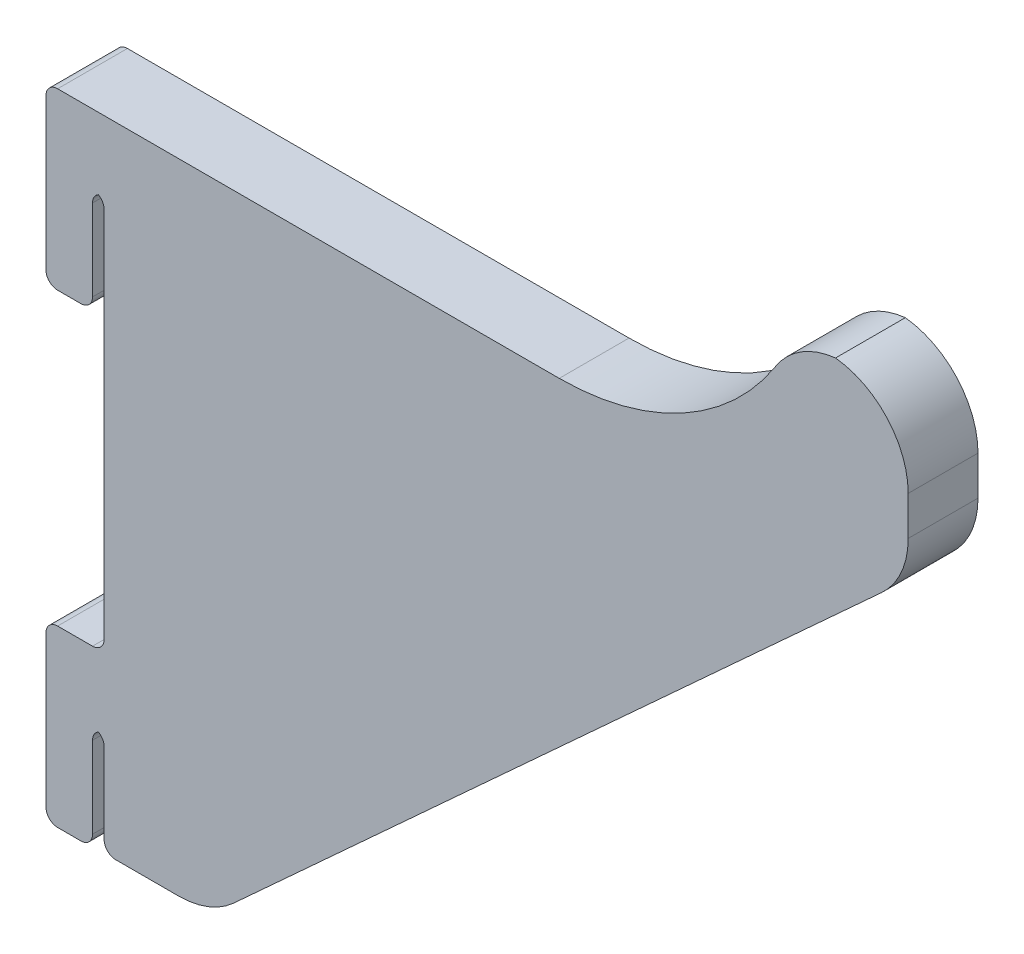
ISO-10303-21;
HEADER;
FILE_DESCRIPTION(('STEP AP214'),'2;1');
FILE_NAME('part.step','',(''),(''),'','','');
FILE_SCHEMA(('AUTOMOTIVE_DESIGN { 1 0 10303 214 1 1 1 1 }'));
ENDSEC;
DATA;
#1=APPLICATION_CONTEXT('core data for automotive mechanical design processes');
#2=APPLICATION_PROTOCOL_DEFINITION('international standard','automotive_design',2000,#1);
#3=PRODUCT_CONTEXT('',#1,'mechanical');
#4=PRODUCT('Part','Part','',(#3));
#5=PRODUCT_RELATED_PRODUCT_CATEGORY('part','',(#4));
#6=PRODUCT_DEFINITION_FORMATION('','',#4);
#7=PRODUCT_DEFINITION_CONTEXT('part definition',#1,'design');
#8=PRODUCT_DEFINITION('design','',#6,#7);
#9=PRODUCT_DEFINITION_SHAPE('','',#8);
#10=(LENGTH_UNIT() NAMED_UNIT(*) SI_UNIT(.MILLI.,.METRE.));
#11=(NAMED_UNIT(*) PLANE_ANGLE_UNIT() SI_UNIT($,.RADIAN.));
#12=(NAMED_UNIT(*) SI_UNIT($,.STERADIAN.) SOLID_ANGLE_UNIT());
#13=UNCERTAINTY_MEASURE_WITH_UNIT(LENGTH_MEASURE(1.E-05),#10,'distance_accuracy_value','');
#14=(GEOMETRIC_REPRESENTATION_CONTEXT(3) GLOBAL_UNCERTAINTY_ASSIGNED_CONTEXT((#13)) GLOBAL_UNIT_ASSIGNED_CONTEXT((#10,
#11,#12)) REPRESENTATION_CONTEXT('',''));
#15=CARTESIAN_POINT('',(0.,0.,0.));
#16=DIRECTION('',(0.,0.,1.));
#17=DIRECTION('',(1.,0.,0.));
#18=AXIS2_PLACEMENT_3D('',#15,#16,#17);
#19=CARTESIAN_POINT('',(0.,0.,3.));
#20=DIRECTION('',(0.,1.,0.));
#21=DIRECTION('',(-1.,0.,0.));
#22=AXIS2_PLACEMENT_3D('',#19,#20,#21);
#23=PLANE('',#22);
#24=DIRECTION('',(1.,0.,0.));
#25=VECTOR('',#24,1.);
#26=CARTESIAN_POINT('',(0.,0.,-3.));
#27=LINE('',#26,#25);
#28=CARTESIAN_POINT('',(-3.,0.,-3.));
#29=VERTEX_POINT('',#28);
#30=CARTESIAN_POINT('',(-1.,0.,-3.));
#31=VERTEX_POINT('',#30);
#32=EDGE_CURVE('E271',#29,#31,#27,.T.);
#33=ORIENTED_EDGE('',*,*,#32,.T.);
#34=DIRECTION('',(0.,0.,-1.));
#35=VECTOR('',#34,1.);
#36=CARTESIAN_POINT('',(-1.,0.,3.));
#37=LINE('',#36,#35);
#38=CARTESIAN_POINT('',(-1.,0.,3.));
#39=VERTEX_POINT('',#38);
#40=EDGE_CURVE('E355',#31,#39,#37,.F.);
#41=ORIENTED_EDGE('',*,*,#40,.T.);
#42=DIRECTION('',(1.,0.,0.));
#43=VECTOR('',#42,1.);
#44=CARTESIAN_POINT('',(0.,0.,3.));
#45=LINE('',#44,#43);
#46=CARTESIAN_POINT('',(-3.,0.,3.));
#47=VERTEX_POINT('',#46);
#48=EDGE_CURVE('E310',#47,#39,#45,.T.);
#49=ORIENTED_EDGE('',*,*,#48,.F.);
#50=DIRECTION('',(0.,0.,-1.));
#51=VECTOR('',#50,1.);
#52=CARTESIAN_POINT('',(-3.,0.,3.));
#53=LINE('',#52,#51);
#54=EDGE_CURVE('E352',#47,#29,#53,.T.);
#55=ORIENTED_EDGE('',*,*,#54,.T.);
#56=EDGE_LOOP('',(#33,#41,#49,#55));
#57=FACE_BOUND('',#56,.T.);
#58=ADVANCED_FACE('F33',(#57),#23,.F.);
#59=CARTESIAN_POINT('',(0.,0.,3.));
#60=DIRECTION('',(-1.,0.,0.));
#61=DIRECTION('',(0.,-1.,0.));
#62=AXIS2_PLACEMENT_3D('',#59,#60,#61);
#63=PLANE('',#62);
#64=DIRECTION('',(0.,1.,0.));
#65=VECTOR('',#64,1.);
#66=CARTESIAN_POINT('',(0.,0.,-3.));
#67=LINE('',#66,#65);
#68=CARTESIAN_POINT('',(0.,1.,-3.));
#69=VERTEX_POINT('',#68);
#70=CARTESIAN_POINT('',(0.,8.,-3.));
#71=VERTEX_POINT('',#70);
#72=EDGE_CURVE('E274',#69,#71,#67,.T.);
#73=ORIENTED_EDGE('',*,*,#72,.T.);
#74=DIRECTION('',(0.,0.,-1.));
#75=VECTOR('',#74,1.);
#76=CARTESIAN_POINT('',(0.,8.,3.));
#77=LINE('',#76,#75);
#78=CARTESIAN_POINT('',(0.,8.,3.));
#79=VERTEX_POINT('',#78);
#80=EDGE_CURVE('E350',#71,#79,#77,.F.);
#81=ORIENTED_EDGE('',*,*,#80,.T.);
#82=DIRECTION('',(0.,1.,0.));
#83=VECTOR('',#82,1.);
#84=CARTESIAN_POINT('',(0.,0.,3.));
#85=LINE('',#84,#83);
#86=CARTESIAN_POINT('',(0.,1.,3.));
#87=VERTEX_POINT('',#86);
#88=EDGE_CURVE('E464',#87,#79,#85,.T.);
#89=ORIENTED_EDGE('',*,*,#88,.F.);
#90=DIRECTION('',(0.,0.,-1.));
#91=VECTOR('',#90,1.);
#92=CARTESIAN_POINT('',(0.,1.,3.));
#93=LINE('',#92,#91);
#94=EDGE_CURVE('E347',#87,#69,#93,.T.);
#95=ORIENTED_EDGE('',*,*,#94,.T.);
#96=EDGE_LOOP('',(#73,#81,#89,#95));
#97=FACE_BOUND('',#96,.T.);
#98=ADVANCED_FACE('F480',(#97),#63,.F.);
#99=CARTESIAN_POINT('',(1.,9.,3.));
#100=DIRECTION('',(1.,0.,0.));
#101=DIRECTION('',(0.,1.,0.));
#102=AXIS2_PLACEMENT_3D('',#99,#100,#101);
#103=PLANE('',#102);
#104=DIRECTION('',(0.,-1.,0.));
#105=VECTOR('',#104,1.);
#106=CARTESIAN_POINT('',(1.,9.,-3.));
#107=LINE('',#106,#105);
#108=CARTESIAN_POINT('',(1.,8.,-3.));
#109=VERTEX_POINT('',#108);
#110=CARTESIAN_POINT('',(1.,1.09638947990709,-3.));
#111=VERTEX_POINT('',#110);
#112=EDGE_CURVE('E278',#109,#111,#107,.T.);
#113=ORIENTED_EDGE('',*,*,#112,.T.);
#114=DIRECTION('',(0.,0.,-1.));
#115=VECTOR('',#114,1.);
#116=CARTESIAN_POINT('',(1.,1.09638947990709,3.));
#117=LINE('',#116,#115);
#118=CARTESIAN_POINT('',(1.,1.09638947990709,3.));
#119=VERTEX_POINT('',#118);
#120=EDGE_CURVE('E331',#111,#119,#117,.F.);
#121=ORIENTED_EDGE('',*,*,#120,.T.);
#122=DIRECTION('',(0.,-1.,0.));
#123=VECTOR('',#122,1.);
#124=CARTESIAN_POINT('',(1.,9.,3.));
#125=LINE('',#124,#123);
#126=CARTESIAN_POINT('',(1.,8.,3.));
#127=VERTEX_POINT('',#126);
#128=EDGE_CURVE('E461',#127,#119,#125,.T.);
#129=ORIENTED_EDGE('',*,*,#128,.F.);
#130=DIRECTION('',(0.,0.,-1.));
#131=VECTOR('',#130,1.);
#132=CARTESIAN_POINT('',(1.,8.,-3.));
#133=LINE('',#132,#131);
#134=EDGE_CURVE('E328',#127,#109,#133,.T.);
#135=ORIENTED_EDGE('',*,*,#134,.T.);
#136=EDGE_LOOP('',(#113,#121,#129,#135));
#137=FACE_BOUND('',#136,.T.);
#138=ADVANCED_FACE('F496',(#137),#103,.F.);
#139=CARTESIAN_POINT('',(1.00000000000001,0.0963894799070881,3.));
#140=DIRECTION('',(0.,1.,0.));
#141=DIRECTION('',(0.,0.,1.));
#142=AXIS2_PLACEMENT_3D('',#139,#140,#141);
#143=PLANE('',#142);
#144=DIRECTION('',(1.,0.,0.));
#145=VECTOR('',#144,1.);
#146=CARTESIAN_POINT('',(1.00000000000001,0.0963894799070881,-3.));
#147=LINE('',#146,#145);
#148=CARTESIAN_POINT('',(2.,0.0963894799070881,-3.));
#149=VERTEX_POINT('',#148);
#150=CARTESIAN_POINT('',(7.40250766942312,0.0963894799070881,-3.));
#151=VERTEX_POINT('',#150);
#152=EDGE_CURVE('E281',#149,#151,#147,.T.);
#153=ORIENTED_EDGE('',*,*,#152,.T.);
#154=DIRECTION('',(0.,0.,-1.));
#155=VECTOR('',#154,1.);
#156=CARTESIAN_POINT('',(7.40250766942312,0.0963894799070881,3.));
#157=LINE('',#156,#155);
#158=CARTESIAN_POINT('',(7.40250766942312,0.0963894799070881,3.));
#159=VERTEX_POINT('',#158);
#160=EDGE_CURVE('E426',#151,#159,#157,.F.);
#161=ORIENTED_EDGE('',*,*,#160,.T.);
#162=DIRECTION('',(1.,0.,0.));
#163=VECTOR('',#162,1.);
#164=CARTESIAN_POINT('',(1.00000000000001,0.0963894799070881,3.));
#165=LINE('',#164,#163);
#166=CARTESIAN_POINT('',(2.,0.0963894799070881,3.));
#167=VERTEX_POINT('',#166);
#168=EDGE_CURVE('E457',#167,#159,#165,.T.);
#169=ORIENTED_EDGE('',*,*,#168,.F.);
#170=DIRECTION('',(0.,0.,-1.));
#171=VECTOR('',#170,1.);
#172=CARTESIAN_POINT('',(2.,0.0963894799070881,3.));
#173=LINE('',#172,#171);
#174=EDGE_CURVE('E245',#167,#149,#173,.T.);
#175=ORIENTED_EDGE('',*,*,#174,.T.);
#176=EDGE_LOOP('',(#153,#161,#169,#175));
#177=FACE_BOUND('',#176,.T.);
#178=ADVANCED_FACE('F504',(#177),#143,.F.);
#179=CARTESIAN_POINT('',(70.1218736182205,55.,3.));
#180=DIRECTION('',(-0.675080348465986,0.737744212525617,0.));
#181=DIRECTION('',(-0.737744212525617,-0.675080348465986,0.));
#182=AXIS2_PLACEMENT_3D('',#179,#180,#181);
#183=PLANE('',#182);
#184=DIRECTION('',(0.737744212525617,0.675080348465986,0.));
#185=VECTOR('',#184,1.);
#186=CARTESIAN_POINT('',(70.1218736182205,55.,3.));
#187=LINE('',#186,#185);
#188=CARTESIAN_POINT('',(12.128070108685,1.93217999222776,3.));
#189=VERTEX_POINT('',#188);
#190=CARTESIAN_POINT('',(67.8474360574824,52.9187527668827,3.));
#191=VERTEX_POINT('',#190);
#192=EDGE_CURVE('E456',#189,#191,#187,.T.);
#193=ORIENTED_EDGE('',*,*,#192,.F.);
#194=DIRECTION('',(0.,0.,-1.));
#195=VECTOR('',#194,1.);
#196=CARTESIAN_POINT('',(12.128070108685,1.93217999222776,3.));
#197=LINE('',#196,#195);
#198=CARTESIAN_POINT('',(12.128070108685,1.93217999222776,-3.));
#199=VERTEX_POINT('',#198);
#200=EDGE_CURVE('E415',#189,#199,#197,.T.);
#201=ORIENTED_EDGE('',*,*,#200,.T.);
#202=DIRECTION('',(0.737744212525617,0.675080348465986,0.));
#203=VECTOR('',#202,1.);
#204=CARTESIAN_POINT('',(70.1218736182205,55.,-3.));
#205=LINE('',#204,#203);
#206=CARTESIAN_POINT('',(67.8474360574824,52.9187527668827,-3.));
#207=VERTEX_POINT('',#206);
#208=EDGE_CURVE('E284',#199,#207,#205,.T.);
#209=ORIENTED_EDGE('',*,*,#208,.T.);
#210=DIRECTION('',(0.,0.,-1.));
#211=VECTOR('',#210,1.);
#212=CARTESIAN_POINT('',(67.8474360574824,52.9187527668827,3.));
#213=LINE('',#212,#211);
#214=EDGE_CURVE('E408',#207,#191,#213,.F.);
#215=ORIENTED_EDGE('',*,*,#214,.T.);
#216=EDGE_LOOP('',(#193,#201,#209,#215));
#217=FACE_BOUND('',#216,.T.);
#218=ADVANCED_FACE('F512',(#217),#183,.F.);
#219=CARTESIAN_POINT('',(70.1218736182205,68.4361947626841,3.));
#220=DIRECTION('',(-1.,0.,0.));
#221=DIRECTION('',(0.,0.,1.));
#222=AXIS2_PLACEMENT_3D('',#219,#220,#221);
#223=PLANE('',#222);
#224=DIRECTION('',(0.,1.,0.));
#225=VECTOR('',#224,1.);
#226=CARTESIAN_POINT('',(70.1218736182205,68.4361947626841,3.));
#227=LINE('',#226,#225);
#228=CARTESIAN_POINT('',(70.1218736182205,58.0829622545621,3.));
#229=VERTEX_POINT('',#228);
#230=CARTESIAN_POINT('',(70.1218736182205,61.4361947626841,3.));
#231=VERTEX_POINT('',#230);
#232=EDGE_CURVE('E235',#229,#231,#227,.T.);
#233=ORIENTED_EDGE('',*,*,#232,.F.);
#234=DIRECTION('',(0.,0.,-1.));
#235=VECTOR('',#234,1.);
#236=CARTESIAN_POINT('',(70.1218736182205,58.0829622545621,3.));
#237=LINE('',#236,#235);
#238=CARTESIAN_POINT('',(70.1218736182205,58.0829622545621,-3.));
#239=VERTEX_POINT('',#238);
#240=EDGE_CURVE('E42',#229,#239,#237,.T.);
#241=ORIENTED_EDGE('',*,*,#240,.T.);
#242=DIRECTION('',(0.,1.,0.));
#243=VECTOR('',#242,1.);
#244=CARTESIAN_POINT('',(70.1218736182205,68.4361947626841,-3.));
#245=LINE('',#244,#243);
#246=CARTESIAN_POINT('',(70.1218736182205,61.4361947626841,-3.));
#247=VERTEX_POINT('',#246);
#248=EDGE_CURVE('E287',#239,#247,#245,.T.);
#249=ORIENTED_EDGE('',*,*,#248,.T.);
#250=DIRECTION('',(0.,0.,-1.));
#251=VECTOR('',#250,1.);
#252=CARTESIAN_POINT('',(70.1218736182205,61.4361947626841,3.));
#253=LINE('',#252,#251);
#254=EDGE_CURVE('E434',#247,#231,#253,.F.);
#255=ORIENTED_EDGE('',*,*,#254,.T.);
#256=EDGE_LOOP('',(#233,#241,#249,#255));
#257=FACE_BOUND('',#256,.T.);
#258=ADVANCED_FACE('F442',(#257),#223,.F.);
#259=CARTESIAN_POINT('',(40.1218736182205,77.0691221980383,3.));
#260=DIRECTION('',(0.,0.,-1.));
#261=DIRECTION('',(-1.,0.,0.));
#262=AXIS2_PLACEMENT_3D('',#259,#260,#261);
#263=CYLINDRICAL_SURFACE('',#262,22.0691221980383);
#264=CARTESIAN_POINT('',(40.1218736182205,77.0691221980383,3.));
#265=DIRECTION('',(0.,0.,-1.));
#266=DIRECTION('',(1.,0.,0.));
#267=AXIS2_PLACEMENT_3D('',#264,#265,#266);
#268=CIRCLE('',#267,22.0691221980383);
#269=CARTESIAN_POINT('',(58.727958816641,65.2006872472513,3.));
#270=VERTEX_POINT('',#269);
#271=CARTESIAN_POINT('',(40.1218736182205,55.,3.));
#272=VERTEX_POINT('',#271);
#273=EDGE_CURVE('E226',#270,#272,#268,.T.);
#274=ORIENTED_EDGE('',*,*,#273,.F.);
#275=DIRECTION('',(0.,0.,-1.));
#276=VECTOR('',#275,1.);
#277=CARTESIAN_POINT('',(58.727958816641,65.2006872472513,3.));
#278=LINE('',#277,#276);
#279=CARTESIAN_POINT('',(58.727958816641,65.2006872472513,-3.));
#280=VERTEX_POINT('',#279);
#281=EDGE_CURVE('E11',#270,#280,#278,.T.);
#282=ORIENTED_EDGE('',*,*,#281,.T.);
#283=CARTESIAN_POINT('',(40.1218736182205,77.0691221980383,-3.));
#284=DIRECTION('',(0.,0.,-1.));
#285=DIRECTION('',(1.,0.,0.));
#286=AXIS2_PLACEMENT_3D('',#283,#284,#285);
#287=CIRCLE('',#286,22.0691221980383);
#288=CARTESIAN_POINT('',(40.1218736182205,55.,-3.));
#289=VERTEX_POINT('',#288);
#290=EDGE_CURVE('E241',#280,#289,#287,.T.);
#291=ORIENTED_EDGE('',*,*,#290,.T.);
#292=DIRECTION('',(0.,0.,-1.));
#293=VECTOR('',#292,1.);
#294=CARTESIAN_POINT('',(40.1218736182205,55.,3.));
#295=LINE('',#294,#293);
#296=EDGE_CURVE('E238',#272,#289,#295,.T.);
#297=ORIENTED_EDGE('',*,*,#296,.F.);
#298=EDGE_LOOP('',(#274,#282,#291,#297));
#299=FACE_BOUND('',#298,.T.);
#300=ADVANCED_FACE('F239',(#299),#263,.F.);
#301=CARTESIAN_POINT('',(10.1218736182205,55.,3.));
#302=DIRECTION('',(0.,-1.,0.));
#303=DIRECTION('',(0.,0.,-1.));
#304=AXIS2_PLACEMENT_3D('',#301,#302,#303);
#305=PLANE('',#304);
#306=DIRECTION('',(-1.,0.,0.));
#307=VECTOR('',#306,1.);
#308=CARTESIAN_POINT('',(10.1218736182205,55.,-3.));
#309=LINE('',#308,#307);
#310=CARTESIAN_POINT('',(-3.00000000000003,55.,-3.));
#311=VERTEX_POINT('',#310);
#312=EDGE_CURVE('E291',#289,#311,#309,.T.);
#313=ORIENTED_EDGE('',*,*,#312,.T.);
#314=DIRECTION('',(0.,0.,-1.));
#315=VECTOR('',#314,1.);
#316=CARTESIAN_POINT('',(-3.00000000000003,55.,3.));
#317=LINE('',#316,#315);
#318=CARTESIAN_POINT('',(-3.00000000000003,55.,3.));
#319=VERTEX_POINT('',#318);
#320=EDGE_CURVE('E250',#311,#319,#317,.F.);
#321=ORIENTED_EDGE('',*,*,#320,.T.);
#322=DIRECTION('',(-1.,0.,0.));
#323=VECTOR('',#322,1.);
#324=CARTESIAN_POINT('',(40.1218736182205,55.,3.));
#325=LINE('',#324,#323);
#326=EDGE_CURVE('E231',#272,#319,#325,.T.);
#327=ORIENTED_EDGE('',*,*,#326,.F.);
#328=ORIENTED_EDGE('',*,*,#296,.T.);
#329=EDGE_LOOP('',(#313,#321,#327,#328));
#330=FACE_BOUND('',#329,.T.);
#331=ADVANCED_FACE('F248',(#330),#305,.F.);
#332=CARTESIAN_POINT('',(-4.00000000000003,40.,3.));
#333=DIRECTION('',(1.,0.,0.));
#334=DIRECTION('',(0.,0.,-1.));
#335=AXIS2_PLACEMENT_3D('',#332,#333,#334);
#336=PLANE('',#335);
#337=DIRECTION('',(0.,-1.,0.));
#338=VECTOR('',#337,1.);
#339=CARTESIAN_POINT('',(-4.00000000000003,40.,-3.));
#340=LINE('',#339,#338);
#341=CARTESIAN_POINT('',(-4.00000000000003,54.,-3.));
#342=VERTEX_POINT('',#341);
#343=CARTESIAN_POINT('',(-4.00000000000003,41.,-3.));
#344=VERTEX_POINT('',#343);
#345=EDGE_CURVE('E293',#342,#344,#340,.T.);
#346=ORIENTED_EDGE('',*,*,#345,.T.);
#347=DIRECTION('',(0.,0.,-1.));
#348=VECTOR('',#347,1.);
#349=CARTESIAN_POINT('',(-4.00000000000003,41.,3.));
#350=LINE('',#349,#348);
#351=CARTESIAN_POINT('',(-4.00000000000003,41.,3.));
#352=VERTEX_POINT('',#351);
#353=EDGE_CURVE('E385',#344,#352,#350,.F.);
#354=ORIENTED_EDGE('',*,*,#353,.T.);
#355=DIRECTION('',(0.,-1.,0.));
#356=VECTOR('',#355,1.);
#357=CARTESIAN_POINT('',(-4.00000000000003,40.,3.));
#358=LINE('',#357,#356);
#359=CARTESIAN_POINT('',(-4.00000000000003,54.,3.));
#360=VERTEX_POINT('',#359);
#361=EDGE_CURVE('E251',#360,#352,#358,.T.);
#362=ORIENTED_EDGE('',*,*,#361,.F.);
#363=DIRECTION('',(0.,0.,-1.));
#364=VECTOR('',#363,1.);
#365=CARTESIAN_POINT('',(-4.00000000000003,54.,3.));
#366=LINE('',#365,#364);
#367=EDGE_CURVE('E382',#360,#342,#366,.T.);
#368=ORIENTED_EDGE('',*,*,#367,.T.);
#369=EDGE_LOOP('',(#346,#354,#362,#368));
#370=FACE_BOUND('',#369,.T.);
#371=ADVANCED_FACE('F613',(#370),#336,.F.);
#372=CARTESIAN_POINT('',(0.,40.,3.));
#373=DIRECTION('',(0.,1.,0.));
#374=DIRECTION('',(-1.,0.,0.));
#375=AXIS2_PLACEMENT_3D('',#372,#373,#374);
#376=PLANE('',#375);
#377=DIRECTION('',(1.,0.,0.));
#378=VECTOR('',#377,1.);
#379=CARTESIAN_POINT('',(0.,40.,-3.));
#380=LINE('',#379,#378);
#381=CARTESIAN_POINT('',(-3.00000000000003,40.,-3.));
#382=VERTEX_POINT('',#381);
#383=CARTESIAN_POINT('',(-1.00000000000003,40.,-3.));
#384=VERTEX_POINT('',#383);
#385=EDGE_CURVE('E296',#382,#384,#380,.T.);
#386=ORIENTED_EDGE('',*,*,#385,.T.);
#387=DIRECTION('',(0.,0.,-1.));
#388=VECTOR('',#387,1.);
#389=CARTESIAN_POINT('',(-1.00000000000003,40.,3.));
#390=LINE('',#389,#388);
#391=CARTESIAN_POINT('',(-1.00000000000003,40.,3.));
#392=VERTEX_POINT('',#391);
#393=EDGE_CURVE('E380',#384,#392,#390,.F.);
#394=ORIENTED_EDGE('',*,*,#393,.T.);
#395=DIRECTION('',(1.,0.,0.));
#396=VECTOR('',#395,1.);
#397=CARTESIAN_POINT('',(0.,40.,3.));
#398=LINE('',#397,#396);
#399=CARTESIAN_POINT('',(-3.00000000000003,40.,3.));
#400=VERTEX_POINT('',#399);
#401=EDGE_CURVE('E254',#400,#392,#398,.T.);
#402=ORIENTED_EDGE('',*,*,#401,.F.);
#403=DIRECTION('',(0.,0.,-1.));
#404=VECTOR('',#403,1.);
#405=CARTESIAN_POINT('',(-3.00000000000003,40.,3.));
#406=LINE('',#405,#404);
#407=EDGE_CURVE('E377',#400,#382,#406,.T.);
#408=ORIENTED_EDGE('',*,*,#407,.T.);
#409=EDGE_LOOP('',(#386,#394,#402,#408));
#410=FACE_BOUND('',#409,.T.);
#411=ADVANCED_FACE('F606',(#410),#376,.F.);
#412=CARTESIAN_POINT('',(0.,49.,3.));
#413=DIRECTION('',(-1.,0.,0.));
#414=DIRECTION('',(0.,-1.,0.));
#415=AXIS2_PLACEMENT_3D('',#412,#413,#414);
#416=PLANE('',#415);
#417=DIRECTION('',(0.,1.,0.));
#418=VECTOR('',#417,1.);
#419=CARTESIAN_POINT('',(0.,49.,3.));
#420=LINE('',#419,#418);
#421=CARTESIAN_POINT('',(0.,41.,3.));
#422=VERTEX_POINT('',#421);
#423=CARTESIAN_POINT('',(0.,48.,3.));
#424=VERTEX_POINT('',#423);
#425=EDGE_CURVE('E260',#422,#424,#420,.T.);
#426=ORIENTED_EDGE('',*,*,#425,.F.);
#427=DIRECTION('',(0.,0.,-1.));
#428=VECTOR('',#427,1.);
#429=CARTESIAN_POINT('',(0.,41.,3.));
#430=LINE('',#429,#428);
#431=CARTESIAN_POINT('',(0.,41.,-3.));
#432=VERTEX_POINT('',#431);
#433=EDGE_CURVE('E374',#422,#432,#430,.T.);
#434=ORIENTED_EDGE('',*,*,#433,.T.);
#435=DIRECTION('',(0.,1.,0.));
#436=VECTOR('',#435,1.);
#437=CARTESIAN_POINT('',(0.,49.,-3.));
#438=LINE('',#437,#436);
#439=CARTESIAN_POINT('',(0.,48.,-3.));
#440=VERTEX_POINT('',#439);
#441=EDGE_CURVE('E299',#432,#440,#438,.T.);
#442=ORIENTED_EDGE('',*,*,#441,.T.);
#443=DIRECTION('',(0.,0.,-1.));
#444=VECTOR('',#443,1.);
#445=CARTESIAN_POINT('',(0.,48.,3.));
#446=LINE('',#445,#444);
#447=EDGE_CURVE('E372',#440,#424,#446,.F.);
#448=ORIENTED_EDGE('',*,*,#447,.T.);
#449=EDGE_LOOP('',(#426,#434,#442,#448));
#450=FACE_BOUND('',#449,.T.);
#451=ADVANCED_FACE('F600',(#450),#416,.F.);
#452=CARTESIAN_POINT('',(0.999999999999987,15.,3.));
#453=DIRECTION('',(1.,0.,0.));
#454=DIRECTION('',(0.,1.,0.));
#455=AXIS2_PLACEMENT_3D('',#452,#453,#454);
#456=PLANE('',#455);
#457=DIRECTION('',(0.,-1.,0.));
#458=VECTOR('',#457,1.);
#459=CARTESIAN_POINT('',(0.999999999999987,15.,-3.));
#460=LINE('',#459,#458);
#461=CARTESIAN_POINT('',(0.999999999999971,48.,-3.));
#462=VERTEX_POINT('',#461);
#463=CARTESIAN_POINT('',(0.999999999999987,16.,-3.));
#464=VERTEX_POINT('',#463);
#465=EDGE_CURVE('E302',#462,#464,#460,.T.);
#466=ORIENTED_EDGE('',*,*,#465,.T.);
#467=DIRECTION('',(0.,0.,-1.));
#468=VECTOR('',#467,1.);
#469=CARTESIAN_POINT('',(0.999999999999987,16.,3.));
#470=LINE('',#469,#468);
#471=CARTESIAN_POINT('',(0.999999999999987,16.,3.));
#472=VERTEX_POINT('',#471);
#473=EDGE_CURVE('E370',#464,#472,#470,.F.);
#474=ORIENTED_EDGE('',*,*,#473,.T.);
#475=DIRECTION('',(0.,-1.,0.));
#476=VECTOR('',#475,1.);
#477=CARTESIAN_POINT('',(0.999999999999987,15.,3.));
#478=LINE('',#477,#476);
#479=CARTESIAN_POINT('',(0.999999999999971,48.,3.));
#480=VERTEX_POINT('',#479);
#481=EDGE_CURVE('E263',#480,#472,#478,.T.);
#482=ORIENTED_EDGE('',*,*,#481,.F.);
#483=DIRECTION('',(0.,0.,-1.));
#484=VECTOR('',#483,1.);
#485=CARTESIAN_POINT('',(0.999999999999971,48.,-3.));
#486=LINE('',#485,#484);
#487=EDGE_CURVE('E367',#480,#462,#486,.T.);
#488=ORIENTED_EDGE('',*,*,#487,.T.);
#489=EDGE_LOOP('',(#466,#474,#482,#488));
#490=FACE_BOUND('',#489,.T.);
#491=ADVANCED_FACE('F581',(#490),#456,.F.);
#492=CARTESIAN_POINT('',(-4.,15.,3.));
#493=DIRECTION('',(0.,-1.,0.));
#494=DIRECTION('',(0.,0.,-1.));
#495=AXIS2_PLACEMENT_3D('',#492,#493,#494);
#496=PLANE('',#495);
#497=DIRECTION('',(-1.,0.,0.));
#498=VECTOR('',#497,1.);
#499=CARTESIAN_POINT('',(-4.,15.,-3.));
#500=LINE('',#499,#498);
#501=CARTESIAN_POINT('',(0.,15.,-3.));
#502=VERTEX_POINT('',#501);
#503=CARTESIAN_POINT('',(-3.,15.,-3.));
#504=VERTEX_POINT('',#503);
#505=EDGE_CURVE('E305',#502,#504,#500,.T.);
#506=ORIENTED_EDGE('',*,*,#505,.T.);
#507=DIRECTION('',(0.,0.,-1.));
#508=VECTOR('',#507,1.);
#509=CARTESIAN_POINT('',(-3.,15.,3.));
#510=LINE('',#509,#508);
#511=CARTESIAN_POINT('',(-3.,15.,3.));
#512=VERTEX_POINT('',#511);
#513=EDGE_CURVE('E365',#504,#512,#510,.F.);
#514=ORIENTED_EDGE('',*,*,#513,.T.);
#515=DIRECTION('',(-1.,0.,0.));
#516=VECTOR('',#515,1.);
#517=CARTESIAN_POINT('',(-4.,15.,3.));
#518=LINE('',#517,#516);
#519=CARTESIAN_POINT('',(0.,15.,3.));
#520=VERTEX_POINT('',#519);
#521=EDGE_CURVE('E266',#520,#512,#518,.T.);
#522=ORIENTED_EDGE('',*,*,#521,.F.);
#523=DIRECTION('',(0.,0.,-1.));
#524=VECTOR('',#523,1.);
#525=CARTESIAN_POINT('',(0.,15.,-3.));
#526=LINE('',#525,#524);
#527=EDGE_CURVE('E362',#520,#502,#526,.T.);
#528=ORIENTED_EDGE('',*,*,#527,.T.);
#529=EDGE_LOOP('',(#506,#514,#522,#528));
#530=FACE_BOUND('',#529,.T.);
#531=ADVANCED_FACE('F588',(#530),#496,.F.);
#532=CARTESIAN_POINT('',(-4.,0.,3.));
#533=DIRECTION('',(1.,0.,0.));
#534=DIRECTION('',(0.,0.,-1.));
#535=AXIS2_PLACEMENT_3D('',#532,#533,#534);
#536=PLANE('',#535);
#537=DIRECTION('',(0.,-1.,0.));
#538=VECTOR('',#537,1.);
#539=CARTESIAN_POINT('',(-4.,0.,-3.));
#540=LINE('',#539,#538);
#541=CARTESIAN_POINT('',(-4.,14.,-3.));
#542=VERTEX_POINT('',#541);
#543=CARTESIAN_POINT('',(-4.,0.999999999999999,-3.));
#544=VERTEX_POINT('',#543);
#545=EDGE_CURVE('E308',#542,#544,#540,.T.);
#546=ORIENTED_EDGE('',*,*,#545,.T.);
#547=DIRECTION('',(0.,0.,-1.));
#548=VECTOR('',#547,1.);
#549=CARTESIAN_POINT('',(-4.,1.,3.));
#550=LINE('',#549,#548);
#551=CARTESIAN_POINT('',(-4.,0.999999999999999,3.));
#552=VERTEX_POINT('',#551);
#553=EDGE_CURVE('E360',#544,#552,#550,.F.);
#554=ORIENTED_EDGE('',*,*,#553,.T.);
#555=DIRECTION('',(0.,-1.,0.));
#556=VECTOR('',#555,1.);
#557=CARTESIAN_POINT('',(-4.,0.,3.));
#558=LINE('',#557,#556);
#559=CARTESIAN_POINT('',(-4.,14.,3.));
#560=VERTEX_POINT('',#559);
#561=EDGE_CURVE('E246',#560,#552,#558,.T.);
#562=ORIENTED_EDGE('',*,*,#561,.F.);
#563=DIRECTION('',(0.,0.,-1.));
#564=VECTOR('',#563,1.);
#565=CARTESIAN_POINT('',(-4.,14.,3.));
#566=LINE('',#565,#564);
#567=EDGE_CURVE('E357',#560,#542,#566,.T.);
#568=ORIENTED_EDGE('',*,*,#567,.T.);
#569=EDGE_LOOP('',(#546,#554,#562,#568));
#570=FACE_BOUND('',#569,.T.);
#571=ADVANCED_FACE('F594',(#570),#536,.F.);
#572=CARTESIAN_POINT('',(40.1218736182205,77.0691221980383,3.));
#573=DIRECTION('',(0.,0.,1.));
#574=DIRECTION('',(1.,0.,0.));
#575=AXIS2_PLACEMENT_3D('',#572,#573,#574);
#576=PLANE('',#575);
#577=ORIENTED_EDGE('',*,*,#168,.T.);
#578=CARTESIAN_POINT('',(7.40250766942312,7.09638947990709,3.));
#579=DIRECTION('',(0.,0.,1.));
#580=DIRECTION('',(1.,0.,0.));
#581=AXIS2_PLACEMENT_3D('',#578,#579,#580);
#582=CIRCLE('',#581,7.);
#583=EDGE_CURVE('E432',#159,#189,#582,.T.);
#584=ORIENTED_EDGE('',*,*,#583,.T.);
#585=ORIENTED_EDGE('',*,*,#192,.T.);
#586=CARTESIAN_POINT('',(63.1218736182205,58.0829622545621,3.));
#587=DIRECTION('',(0.,0.,1.));
#588=DIRECTION('',(1.,0.,0.));
#589=AXIS2_PLACEMENT_3D('',#586,#587,#588);
#590=CIRCLE('',#589,7.);
#591=EDGE_CURVE('E430',#191,#229,#590,.T.);
#592=ORIENTED_EDGE('',*,*,#591,.T.);
#593=ORIENTED_EDGE('',*,*,#232,.T.);
#594=CARTESIAN_POINT('',(63.1218736182205,61.4361947626841,3.));
#595=DIRECTION('',(0.,0.,1.));
#596=DIRECTION('',(1.,0.,0.));
#597=AXIS2_PLACEMENT_3D('',#594,#595,#596);
#598=CIRCLE('',#597,7.);
#599=CARTESIAN_POINT('',(63.8757040924583,68.3954863657218,3.));
#600=VERTEX_POINT('',#599);
#601=EDGE_CURVE('E49',#231,#600,#598,.T.);
#602=ORIENTED_EDGE('',*,*,#601,.T.);
#603=CARTESIAN_POINT('',(64.629534566696,61.4361947626841,3.));
#604=DIRECTION('',(0.,0.,1.));
#605=DIRECTION('',(1.,0.,0.));
#606=AXIS2_PLACEMENT_3D('',#603,#604,#605);
#607=CIRCLE('',#606,7.);
#608=EDGE_CURVE('E53',#600,#270,#607,.T.);
#609=ORIENTED_EDGE('',*,*,#608,.T.);
#610=ORIENTED_EDGE('',*,*,#273,.T.);
#611=ORIENTED_EDGE('',*,*,#326,.T.);
#612=CARTESIAN_POINT('',(-3.00000000000003,54.,3.));
#613=DIRECTION('',(0.,0.,1.));
#614=DIRECTION('',(1.,0.,0.));
#615=AXIS2_PLACEMENT_3D('',#612,#613,#614);
#616=CIRCLE('',#615,1.);
#617=EDGE_CURVE('E333',#319,#360,#616,.T.);
#618=ORIENTED_EDGE('',*,*,#617,.T.);
#619=ORIENTED_EDGE('',*,*,#361,.T.);
#620=CARTESIAN_POINT('',(-3.00000000000003,41.,3.));
#621=DIRECTION('',(0.,0.,1.));
#622=DIRECTION('',(1.,0.,0.));
#623=AXIS2_PLACEMENT_3D('',#620,#621,#622);
#624=CIRCLE('',#623,1.);
#625=EDGE_CURVE('E335',#352,#400,#624,.T.);
#626=ORIENTED_EDGE('',*,*,#625,.T.);
#627=ORIENTED_EDGE('',*,*,#401,.T.);
#628=CARTESIAN_POINT('',(-1.00000000000003,41.,3.));
#629=DIRECTION('',(0.,0.,1.));
#630=DIRECTION('',(1.,0.,0.));
#631=AXIS2_PLACEMENT_3D('',#628,#629,#630);
#632=CIRCLE('',#631,1.);
#633=EDGE_CURVE('E337',#392,#422,#632,.T.);
#634=ORIENTED_EDGE('',*,*,#633,.T.);
#635=ORIENTED_EDGE('',*,*,#425,.T.);
#636=CARTESIAN_POINT('',(0.999999999999971,48.,3.));
#637=DIRECTION('',(0.,0.,1.));
#638=DIRECTION('',(1.,0.,0.));
#639=AXIS2_PLACEMENT_3D('',#636,#637,#638);
#640=CIRCLE('',#639,1.);
#641=CARTESIAN_POINT('',(0.499999999999972,48.8660254037844,3.));
#642=VERTEX_POINT('',#641);
#643=EDGE_CURVE('E406',#424,#642,#640,.F.);
#644=ORIENTED_EDGE('',*,*,#643,.T.);
#645=CARTESIAN_POINT('',(0.,48.,3.));
#646=DIRECTION('',(0.,0.,1.));
#647=DIRECTION('',(1.,0.,0.));
#648=AXIS2_PLACEMENT_3D('',#645,#646,#647);
#649=CIRCLE('',#648,1.);
#650=EDGE_CURVE('E402',#642,#480,#649,.F.);
#651=ORIENTED_EDGE('',*,*,#650,.T.);
#652=ORIENTED_EDGE('',*,*,#481,.T.);
#653=CARTESIAN_POINT('',(0.,16.,3.));
#654=DIRECTION('',(0.,0.,1.));
#655=DIRECTION('',(1.,0.,0.));
#656=AXIS2_PLACEMENT_3D('',#653,#654,#655);
#657=CIRCLE('',#656,1.);
#658=EDGE_CURVE('E398',#472,#520,#657,.F.);
#659=ORIENTED_EDGE('',*,*,#658,.T.);
#660=ORIENTED_EDGE('',*,*,#521,.T.);
#661=CARTESIAN_POINT('',(-3.,14.,3.));
#662=DIRECTION('',(0.,0.,1.));
#663=DIRECTION('',(1.,0.,0.));
#664=AXIS2_PLACEMENT_3D('',#661,#662,#663);
#665=CIRCLE('',#664,1.);
#666=EDGE_CURVE('E339',#512,#560,#665,.T.);
#667=ORIENTED_EDGE('',*,*,#666,.T.);
#668=ORIENTED_EDGE('',*,*,#561,.T.);
#669=CARTESIAN_POINT('',(-3.,1.,3.));
#670=DIRECTION('',(0.,0.,1.));
#671=DIRECTION('',(1.,0.,0.));
#672=AXIS2_PLACEMENT_3D('',#669,#670,#671);
#673=CIRCLE('',#672,1.);
#674=EDGE_CURVE('E341',#552,#47,#673,.T.);
#675=ORIENTED_EDGE('',*,*,#674,.T.);
#676=ORIENTED_EDGE('',*,*,#48,.T.);
#677=CARTESIAN_POINT('',(-1.,1.,3.));
#678=DIRECTION('',(0.,0.,1.));
#679=DIRECTION('',(1.,0.,0.));
#680=AXIS2_PLACEMENT_3D('',#677,#678,#679);
#681=CIRCLE('',#680,1.);
#682=EDGE_CURVE('E343',#39,#87,#681,.T.);
#683=ORIENTED_EDGE('',*,*,#682,.T.);
#684=ORIENTED_EDGE('',*,*,#88,.T.);
#685=CARTESIAN_POINT('',(1.,8.,3.));
#686=DIRECTION('',(0.,0.,1.));
#687=DIRECTION('',(1.,0.,0.));
#688=AXIS2_PLACEMENT_3D('',#685,#686,#687);
#689=CIRCLE('',#688,1.);
#690=CARTESIAN_POINT('',(0.5,8.86602540378444,3.));
#691=VERTEX_POINT('',#690);
#692=EDGE_CURVE('E394',#79,#691,#689,.F.);
#693=ORIENTED_EDGE('',*,*,#692,.T.);
#694=CARTESIAN_POINT('',(0.,8.,3.));
#695=DIRECTION('',(0.,0.,1.));
#696=DIRECTION('',(1.,0.,0.));
#697=AXIS2_PLACEMENT_3D('',#694,#695,#696);
#698=CIRCLE('',#697,1.);
#699=EDGE_CURVE('E390',#691,#127,#698,.F.);
#700=ORIENTED_EDGE('',*,*,#699,.T.);
#701=ORIENTED_EDGE('',*,*,#128,.T.);
#702=CARTESIAN_POINT('',(2.,1.09638947990709,3.));
#703=DIRECTION('',(0.,0.,1.));
#704=DIRECTION('',(1.,0.,0.));
#705=AXIS2_PLACEMENT_3D('',#702,#703,#704);
#706=CIRCLE('',#705,1.);
#707=EDGE_CURVE('E345',#119,#167,#706,.T.);
#708=ORIENTED_EDGE('',*,*,#707,.T.);
#709=EDGE_LOOP('',(#577,#584,#585,#592,#593,#602,#609,#610,#611,#618,#619,#626,#627,#634,#635,
#644,#651,#652,#659,#660,#667,#668,#675,#676,#683,#684,#693,#700,#701,#708));
#710=FACE_BOUND('',#709,.T.);
#711=ADVANCED_FACE('F229',(#710),#576,.T.);
#712=CARTESIAN_POINT('',(40.1218736182205,77.0691221980383,-3.));
#713=DIRECTION('',(0.,0.,1.));
#714=DIRECTION('',(1.,0.,0.));
#715=AXIS2_PLACEMENT_3D('',#712,#713,#714);
#716=PLANE('',#715);
#717=ORIENTED_EDGE('',*,*,#208,.F.);
#718=CARTESIAN_POINT('',(7.40250766942312,7.09638947990709,-3.));
#719=DIRECTION('',(0.,0.,1.));
#720=DIRECTION('',(1.,0.,0.));
#721=AXIS2_PLACEMENT_3D('',#718,#719,#720);
#722=CIRCLE('',#721,7.);
#723=EDGE_CURVE('E424',#199,#151,#722,.F.);
#724=ORIENTED_EDGE('',*,*,#723,.T.);
#725=ORIENTED_EDGE('',*,*,#152,.F.);
#726=CARTESIAN_POINT('',(2.,1.09638947990709,-3.));
#727=DIRECTION('',(0.,0.,1.));
#728=DIRECTION('',(1.,0.,0.));
#729=AXIS2_PLACEMENT_3D('',#726,#727,#728);
#730=CIRCLE('',#729,1.);
#731=EDGE_CURVE('E326',#149,#111,#730,.F.);
#732=ORIENTED_EDGE('',*,*,#731,.T.);
#733=ORIENTED_EDGE('',*,*,#112,.F.);
#734=CARTESIAN_POINT('',(0.,8.,-3.));
#735=DIRECTION('',(0.,0.,1.));
#736=DIRECTION('',(1.,0.,0.));
#737=AXIS2_PLACEMENT_3D('',#734,#735,#736);
#738=CIRCLE('',#737,1.);
#739=CARTESIAN_POINT('',(0.5,8.86602540378444,-3.));
#740=VERTEX_POINT('',#739);
#741=EDGE_CURVE('E388',#109,#740,#738,.T.);
#742=ORIENTED_EDGE('',*,*,#741,.T.);
#743=CARTESIAN_POINT('',(1.,8.,-3.));
#744=DIRECTION('',(0.,0.,1.));
#745=DIRECTION('',(1.,0.,0.));
#746=AXIS2_PLACEMENT_3D('',#743,#744,#745);
#747=CIRCLE('',#746,1.);
#748=EDGE_CURVE('E392',#740,#71,#747,.T.);
#749=ORIENTED_EDGE('',*,*,#748,.T.);
#750=ORIENTED_EDGE('',*,*,#72,.F.);
#751=CARTESIAN_POINT('',(-1.,1.,-3.));
#752=DIRECTION('',(0.,0.,1.));
#753=DIRECTION('',(1.,0.,0.));
#754=AXIS2_PLACEMENT_3D('',#751,#752,#753);
#755=CIRCLE('',#754,1.);
#756=EDGE_CURVE('E324',#69,#31,#755,.F.);
#757=ORIENTED_EDGE('',*,*,#756,.T.);
#758=ORIENTED_EDGE('',*,*,#32,.F.);
#759=CARTESIAN_POINT('',(-3.,1.,-3.));
#760=DIRECTION('',(0.,0.,1.));
#761=DIRECTION('',(1.,0.,0.));
#762=AXIS2_PLACEMENT_3D('',#759,#760,#761);
#763=CIRCLE('',#762,1.);
#764=EDGE_CURVE('E322',#29,#544,#763,.F.);
#765=ORIENTED_EDGE('',*,*,#764,.T.);
#766=ORIENTED_EDGE('',*,*,#545,.F.);
#767=CARTESIAN_POINT('',(-3.,14.,-3.));
#768=DIRECTION('',(0.,0.,1.));
#769=DIRECTION('',(1.,0.,0.));
#770=AXIS2_PLACEMENT_3D('',#767,#768,#769);
#771=CIRCLE('',#770,1.);
#772=EDGE_CURVE('E320',#542,#504,#771,.F.);
#773=ORIENTED_EDGE('',*,*,#772,.T.);
#774=ORIENTED_EDGE('',*,*,#505,.F.);
#775=CARTESIAN_POINT('',(0.,16.,-3.));
#776=DIRECTION('',(0.,0.,1.));
#777=DIRECTION('',(1.,0.,0.));
#778=AXIS2_PLACEMENT_3D('',#775,#776,#777);
#779=CIRCLE('',#778,1.);
#780=EDGE_CURVE('E396',#502,#464,#779,.T.);
#781=ORIENTED_EDGE('',*,*,#780,.T.);
#782=ORIENTED_EDGE('',*,*,#465,.F.);
#783=CARTESIAN_POINT('',(0.,48.,-3.));
#784=DIRECTION('',(0.,0.,1.));
#785=DIRECTION('',(1.,0.,0.));
#786=AXIS2_PLACEMENT_3D('',#783,#784,#785);
#787=CIRCLE('',#786,1.);
#788=CARTESIAN_POINT('',(0.499999999999972,48.8660254037844,-3.));
#789=VERTEX_POINT('',#788);
#790=EDGE_CURVE('E400',#462,#789,#787,.T.);
#791=ORIENTED_EDGE('',*,*,#790,.T.);
#792=CARTESIAN_POINT('',(0.999999999999971,48.,-3.));
#793=DIRECTION('',(0.,0.,1.));
#794=DIRECTION('',(1.,0.,0.));
#795=AXIS2_PLACEMENT_3D('',#792,#793,#794);
#796=CIRCLE('',#795,1.);
#797=EDGE_CURVE('E404',#789,#440,#796,.T.);
#798=ORIENTED_EDGE('',*,*,#797,.T.);
#799=ORIENTED_EDGE('',*,*,#441,.F.);
#800=CARTESIAN_POINT('',(-1.00000000000003,41.,-3.));
#801=DIRECTION('',(0.,0.,1.));
#802=DIRECTION('',(1.,0.,0.));
#803=AXIS2_PLACEMENT_3D('',#800,#801,#802);
#804=CIRCLE('',#803,1.);
#805=EDGE_CURVE('E318',#432,#384,#804,.F.);
#806=ORIENTED_EDGE('',*,*,#805,.T.);
#807=ORIENTED_EDGE('',*,*,#385,.F.);
#808=CARTESIAN_POINT('',(-3.00000000000003,41.,-3.));
#809=DIRECTION('',(0.,0.,1.));
#810=DIRECTION('',(1.,0.,0.));
#811=AXIS2_PLACEMENT_3D('',#808,#809,#810);
#812=CIRCLE('',#811,1.);
#813=EDGE_CURVE('E316',#382,#344,#812,.F.);
#814=ORIENTED_EDGE('',*,*,#813,.T.);
#815=ORIENTED_EDGE('',*,*,#345,.F.);
#816=CARTESIAN_POINT('',(-3.00000000000003,54.,-3.));
#817=DIRECTION('',(0.,0.,1.));
#818=DIRECTION('',(1.,0.,0.));
#819=AXIS2_PLACEMENT_3D('',#816,#817,#818);
#820=CIRCLE('',#819,1.);
#821=EDGE_CURVE('E314',#342,#311,#820,.F.);
#822=ORIENTED_EDGE('',*,*,#821,.T.);
#823=ORIENTED_EDGE('',*,*,#312,.F.);
#824=ORIENTED_EDGE('',*,*,#290,.F.);
#825=CARTESIAN_POINT('',(64.629534566696,61.4361947626841,-3.));
#826=DIRECTION('',(0.,0.,1.));
#827=DIRECTION('',(1.,0.,0.));
#828=AXIS2_PLACEMENT_3D('',#825,#826,#827);
#829=CIRCLE('',#828,7.);
#830=CARTESIAN_POINT('',(63.8757040924583,68.3954863657218,-3.));
#831=VERTEX_POINT('',#830);
#832=EDGE_CURVE('E418',#280,#831,#829,.F.);
#833=ORIENTED_EDGE('',*,*,#832,.T.);
#834=CARTESIAN_POINT('',(63.1218736182205,61.4361947626841,-3.));
#835=DIRECTION('',(0.,0.,1.));
#836=DIRECTION('',(1.,0.,0.));
#837=AXIS2_PLACEMENT_3D('',#834,#835,#836);
#838=CIRCLE('',#837,7.);
#839=EDGE_CURVE('E420',#831,#247,#838,.F.);
#840=ORIENTED_EDGE('',*,*,#839,.T.);
#841=ORIENTED_EDGE('',*,*,#248,.F.);
#842=CARTESIAN_POINT('',(63.1218736182205,58.0829622545621,-3.));
#843=DIRECTION('',(0.,0.,1.));
#844=DIRECTION('',(1.,0.,0.));
#845=AXIS2_PLACEMENT_3D('',#842,#843,#844);
#846=CIRCLE('',#845,7.);
#847=EDGE_CURVE('E422',#239,#207,#846,.F.);
#848=ORIENTED_EDGE('',*,*,#847,.T.);
#849=EDGE_LOOP('',(#717,#724,#725,#732,#733,#742,#749,#750,#757,#758,#765,#766,#773,#774,#781,
#782,#791,#798,#799,#806,#807,#814,#815,#822,#823,#824,#833,#840,#841,#848));
#850=FACE_BOUND('',#849,.T.);
#851=ADVANCED_FACE('F448',(#850),#716,.F.);
#852=CARTESIAN_POINT('',(2.,1.09638947990709,3.));
#853=DIRECTION('',(0.,0.,-1.));
#854=DIRECTION('',(-1.,0.,0.));
#855=AXIS2_PLACEMENT_3D('',#852,#853,#854);
#856=CYLINDRICAL_SURFACE('',#855,1.);
#857=ORIENTED_EDGE('',*,*,#707,.F.);
#858=ORIENTED_EDGE('',*,*,#120,.F.);
#859=ORIENTED_EDGE('',*,*,#731,.F.);
#860=ORIENTED_EDGE('',*,*,#174,.F.);
#861=EDGE_LOOP('',(#857,#858,#859,#860));
#862=FACE_BOUND('',#861,.T.);
#863=ADVANCED_FACE('F499',(#862),#856,.T.);
#864=CARTESIAN_POINT('',(1.,8.,3.));
#865=DIRECTION('',(0.,0.,1.));
#866=DIRECTION('',(1.,0.,0.));
#867=AXIS2_PLACEMENT_3D('',#864,#865,#866);
#868=CYLINDRICAL_SURFACE('',#867,1.);
#869=DIRECTION('',(0.,0.,1.));
#870=VECTOR('',#869,1.);
#871=CARTESIAN_POINT('',(0.5,8.86602540378444,0.));
#872=LINE('',#871,#870);
#873=EDGE_CURVE('E275',#691,#740,#872,.F.);
#874=ORIENTED_EDGE('',*,*,#873,.F.);
#875=ORIENTED_EDGE('',*,*,#692,.F.);
#876=ORIENTED_EDGE('',*,*,#80,.F.);
#877=ORIENTED_EDGE('',*,*,#748,.F.);
#878=EDGE_LOOP('',(#874,#875,#876,#877));
#879=FACE_BOUND('',#878,.T.);
#880=ADVANCED_FACE('F487',(#879),#868,.F.);
#881=CARTESIAN_POINT('',(0.,8.,3.));
#882=DIRECTION('',(0.,0.,1.));
#883=DIRECTION('',(1.,0.,0.));
#884=AXIS2_PLACEMENT_3D('',#881,#882,#883);
#885=CYLINDRICAL_SURFACE('',#884,1.);
#886=ORIENTED_EDGE('',*,*,#699,.F.);
#887=ORIENTED_EDGE('',*,*,#873,.T.);
#888=ORIENTED_EDGE('',*,*,#741,.F.);
#889=ORIENTED_EDGE('',*,*,#134,.F.);
#890=EDGE_LOOP('',(#886,#887,#888,#889));
#891=FACE_BOUND('',#890,.T.);
#892=ADVANCED_FACE('F491',(#891),#885,.F.);
#893=CARTESIAN_POINT('',(-1.,1.,3.));
#894=DIRECTION('',(0.,0.,-1.));
#895=DIRECTION('',(-1.,0.,0.));
#896=AXIS2_PLACEMENT_3D('',#893,#894,#895);
#897=CYLINDRICAL_SURFACE('',#896,1.);
#898=ORIENTED_EDGE('',*,*,#682,.F.);
#899=ORIENTED_EDGE('',*,*,#40,.F.);
#900=ORIENTED_EDGE('',*,*,#756,.F.);
#901=ORIENTED_EDGE('',*,*,#94,.F.);
#902=EDGE_LOOP('',(#898,#899,#900,#901));
#903=FACE_BOUND('',#902,.T.);
#904=ADVANCED_FACE('F477',(#903),#897,.T.);
#905=CARTESIAN_POINT('',(-3.,1.,3.));
#906=DIRECTION('',(0.,0.,-1.));
#907=DIRECTION('',(-1.,0.,0.));
#908=AXIS2_PLACEMENT_3D('',#905,#906,#907);
#909=CYLINDRICAL_SURFACE('',#908,1.);
#910=ORIENTED_EDGE('',*,*,#674,.F.);
#911=ORIENTED_EDGE('',*,*,#553,.F.);
#912=ORIENTED_EDGE('',*,*,#764,.F.);
#913=ORIENTED_EDGE('',*,*,#54,.F.);
#914=EDGE_LOOP('',(#910,#911,#912,#913));
#915=FACE_BOUND('',#914,.T.);
#916=ADVANCED_FACE('F540',(#915),#909,.T.);
#917=CARTESIAN_POINT('',(-3.,14.,3.));
#918=DIRECTION('',(0.,0.,-1.));
#919=DIRECTION('',(-1.,0.,0.));
#920=AXIS2_PLACEMENT_3D('',#917,#918,#919);
#921=CYLINDRICAL_SURFACE('',#920,1.);
#922=ORIENTED_EDGE('',*,*,#666,.F.);
#923=ORIENTED_EDGE('',*,*,#513,.F.);
#924=ORIENTED_EDGE('',*,*,#772,.F.);
#925=ORIENTED_EDGE('',*,*,#567,.F.);
#926=EDGE_LOOP('',(#922,#923,#924,#925));
#927=FACE_BOUND('',#926,.T.);
#928=ADVANCED_FACE('F543',(#927),#921,.T.);
#929=CARTESIAN_POINT('',(0.,16.,3.));
#930=DIRECTION('',(0.,0.,1.));
#931=DIRECTION('',(1.,0.,0.));
#932=AXIS2_PLACEMENT_3D('',#929,#930,#931);
#933=CYLINDRICAL_SURFACE('',#932,1.);
#934=ORIENTED_EDGE('',*,*,#658,.F.);
#935=ORIENTED_EDGE('',*,*,#473,.F.);
#936=ORIENTED_EDGE('',*,*,#780,.F.);
#937=ORIENTED_EDGE('',*,*,#527,.F.);
#938=EDGE_LOOP('',(#934,#935,#936,#937));
#939=FACE_BOUND('',#938,.T.);
#940=ADVANCED_FACE('F547',(#939),#933,.F.);
#941=CARTESIAN_POINT('',(-1.00000000000003,41.,3.));
#942=DIRECTION('',(0.,0.,-1.));
#943=DIRECTION('',(-1.,0.,0.));
#944=AXIS2_PLACEMENT_3D('',#941,#942,#943);
#945=CYLINDRICAL_SURFACE('',#944,1.);
#946=ORIENTED_EDGE('',*,*,#633,.F.);
#947=ORIENTED_EDGE('',*,*,#393,.F.);
#948=ORIENTED_EDGE('',*,*,#805,.F.);
#949=ORIENTED_EDGE('',*,*,#433,.F.);
#950=EDGE_LOOP('',(#946,#947,#948,#949));
#951=FACE_BOUND('',#950,.T.);
#952=ADVANCED_FACE('F551',(#951),#945,.T.);
#953=CARTESIAN_POINT('',(-3.00000000000003,41.,3.));
#954=DIRECTION('',(0.,0.,-1.));
#955=DIRECTION('',(-1.,0.,0.));
#956=AXIS2_PLACEMENT_3D('',#953,#954,#955);
#957=CYLINDRICAL_SURFACE('',#956,1.);
#958=ORIENTED_EDGE('',*,*,#625,.F.);
#959=ORIENTED_EDGE('',*,*,#353,.F.);
#960=ORIENTED_EDGE('',*,*,#813,.F.);
#961=ORIENTED_EDGE('',*,*,#407,.F.);
#962=EDGE_LOOP('',(#958,#959,#960,#961));
#963=FACE_BOUND('',#962,.T.);
#964=ADVANCED_FACE('F555',(#963),#957,.T.);
#965=CARTESIAN_POINT('',(-3.00000000000003,54.,3.));
#966=DIRECTION('',(0.,0.,-1.));
#967=DIRECTION('',(-1.,0.,0.));
#968=AXIS2_PLACEMENT_3D('',#965,#966,#967);
#969=CYLINDRICAL_SURFACE('',#968,1.);
#970=ORIENTED_EDGE('',*,*,#617,.F.);
#971=ORIENTED_EDGE('',*,*,#320,.F.);
#972=ORIENTED_EDGE('',*,*,#821,.F.);
#973=ORIENTED_EDGE('',*,*,#367,.F.);
#974=EDGE_LOOP('',(#970,#971,#972,#973));
#975=FACE_BOUND('',#974,.T.);
#976=ADVANCED_FACE('F559',(#975),#969,.T.);
#977=CARTESIAN_POINT('',(0.999999999999971,48.,3.));
#978=DIRECTION('',(0.,0.,1.));
#979=DIRECTION('',(1.,0.,0.));
#980=AXIS2_PLACEMENT_3D('',#977,#978,#979);
#981=CYLINDRICAL_SURFACE('',#980,1.);
#982=DIRECTION('',(0.,0.,1.));
#983=VECTOR('',#982,1.);
#984=CARTESIAN_POINT('',(0.499999999999971,48.8660254037844,0.));
#985=LINE('',#984,#983);
#986=EDGE_CURVE('E411',#642,#789,#985,.F.);
#987=ORIENTED_EDGE('',*,*,#986,.F.);
#988=ORIENTED_EDGE('',*,*,#643,.F.);
#989=ORIENTED_EDGE('',*,*,#447,.F.);
#990=ORIENTED_EDGE('',*,*,#797,.F.);
#991=EDGE_LOOP('',(#987,#988,#989,#990));
#992=FACE_BOUND('',#991,.T.);
#993=ADVANCED_FACE('F563',(#992),#981,.F.);
#994=CARTESIAN_POINT('',(0.,48.,3.));
#995=DIRECTION('',(0.,0.,1.));
#996=DIRECTION('',(1.,0.,0.));
#997=AXIS2_PLACEMENT_3D('',#994,#995,#996);
#998=CYLINDRICAL_SURFACE('',#997,1.);
#999=ORIENTED_EDGE('',*,*,#650,.F.);
#1000=ORIENTED_EDGE('',*,*,#986,.T.);
#1001=ORIENTED_EDGE('',*,*,#790,.F.);
#1002=ORIENTED_EDGE('',*,*,#487,.F.);
#1003=EDGE_LOOP('',(#999,#1000,#1001,#1002));
#1004=FACE_BOUND('',#1003,.T.);
#1005=ADVANCED_FACE('F522',(#1004),#998,.F.);
#1006=CARTESIAN_POINT('',(7.40250766942312,7.09638947990709,3.));
#1007=DIRECTION('',(0.,0.,-1.));
#1008=DIRECTION('',(-1.,0.,0.));
#1009=AXIS2_PLACEMENT_3D('',#1006,#1007,#1008);
#1010=CYLINDRICAL_SURFACE('',#1009,7.);
#1011=ORIENTED_EDGE('',*,*,#583,.F.);
#1012=ORIENTED_EDGE('',*,*,#160,.F.);
#1013=ORIENTED_EDGE('',*,*,#723,.F.);
#1014=ORIENTED_EDGE('',*,*,#200,.F.);
#1015=EDGE_LOOP('',(#1011,#1012,#1013,#1014));
#1016=FACE_BOUND('',#1015,.T.);
#1017=ADVANCED_FACE('F508',(#1016),#1010,.T.);
#1018=CARTESIAN_POINT('',(63.1218736182205,58.0829622545621,3.));
#1019=DIRECTION('',(0.,0.,-1.));
#1020=DIRECTION('',(-1.,0.,0.));
#1021=AXIS2_PLACEMENT_3D('',#1018,#1019,#1020);
#1022=CYLINDRICAL_SURFACE('',#1021,7.);
#1023=ORIENTED_EDGE('',*,*,#591,.F.);
#1024=ORIENTED_EDGE('',*,*,#214,.F.);
#1025=ORIENTED_EDGE('',*,*,#847,.F.);
#1026=ORIENTED_EDGE('',*,*,#240,.F.);
#1027=EDGE_LOOP('',(#1023,#1024,#1025,#1026));
#1028=FACE_BOUND('',#1027,.T.);
#1029=ADVANCED_FACE('F514',(#1028),#1022,.T.);
#1030=CARTESIAN_POINT('',(64.629534566696,61.4361947626841,3.));
#1031=DIRECTION('',(0.,0.,-1.));
#1032=DIRECTION('',(-1.,0.,0.));
#1033=AXIS2_PLACEMENT_3D('',#1030,#1031,#1032);
#1034=CYLINDRICAL_SURFACE('',#1033,7.);
#1035=ORIENTED_EDGE('',*,*,#281,.F.);
#1036=ORIENTED_EDGE('',*,*,#608,.F.);
#1037=DIRECTION('',(0.,0.,-1.));
#1038=VECTOR('',#1037,1.);
#1039=CARTESIAN_POINT('',(63.8757040924583,68.3954863657218,0.));
#1040=LINE('',#1039,#1038);
#1041=EDGE_CURVE('E37',#831,#600,#1040,.F.);
#1042=ORIENTED_EDGE('',*,*,#1041,.F.);
#1043=ORIENTED_EDGE('',*,*,#832,.F.);
#1044=EDGE_LOOP('',(#1035,#1036,#1042,#1043));
#1045=FACE_BOUND('',#1044,.T.);
#1046=ADVANCED_FACE('F35',(#1045),#1034,.T.);
#1047=CARTESIAN_POINT('',(63.1218736182205,61.4361947626841,3.));
#1048=DIRECTION('',(0.,0.,-1.));
#1049=DIRECTION('',(-1.,0.,0.));
#1050=AXIS2_PLACEMENT_3D('',#1047,#1048,#1049);
#1051=CYLINDRICAL_SURFACE('',#1050,7.);
#1052=ORIENTED_EDGE('',*,*,#601,.F.);
#1053=ORIENTED_EDGE('',*,*,#254,.F.);
#1054=ORIENTED_EDGE('',*,*,#839,.F.);
#1055=ORIENTED_EDGE('',*,*,#1041,.T.);
#1056=EDGE_LOOP('',(#1052,#1053,#1054,#1055));
#1057=FACE_BOUND('',#1056,.T.);
#1058=ADVANCED_FACE('F454',(#1057),#1051,.T.);
#1059=CLOSED_SHELL('',(#58,#98,#138,#178,#218,#258,#300,#331,#371,#411,#451,#491,#531,#571,#711,
#851,#863,#880,#892,#904,#916,#928,#940,#952,#964,#976,#993,#1005,#1017,#1029,#1046,#1058));
#1060=MANIFOLD_SOLID_BREP('B2',#1059);
#1061=ADVANCED_BREP_SHAPE_REPRESENTATION('',(#18,#1060),#14);
#1062=SHAPE_DEFINITION_REPRESENTATION(#9,#1061);
ENDSEC;
END-ISO-10303-21;
